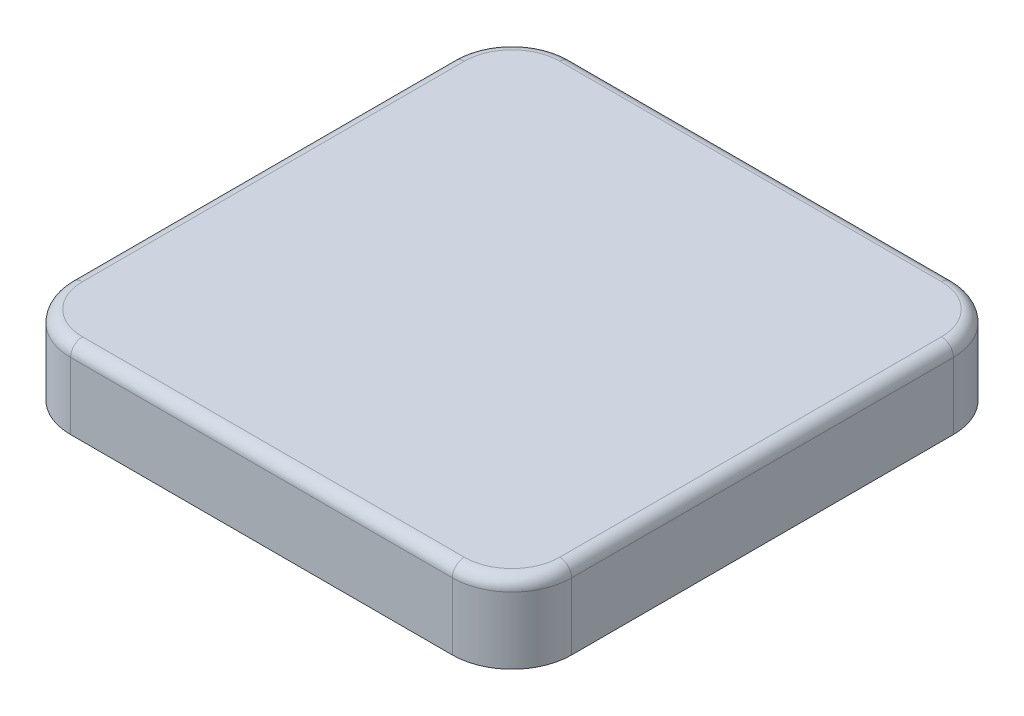
ISO-10303-21;
HEADER;
FILE_DESCRIPTION(('STEP AP214'),'2;1');
FILE_NAME('part.step','',(''),(''),'','','');
FILE_SCHEMA(('AUTOMOTIVE_DESIGN { 1 0 10303 214 1 1 1 1 }'));
ENDSEC;
DATA;
#1=APPLICATION_CONTEXT('core data for automotive mechanical design processes');
#2=APPLICATION_PROTOCOL_DEFINITION('international standard','automotive_design',2000,#1);
#3=PRODUCT_CONTEXT('',#1,'mechanical');
#4=PRODUCT('Part','Part','',(#3));
#5=PRODUCT_RELATED_PRODUCT_CATEGORY('part','',(#4));
#6=PRODUCT_DEFINITION_FORMATION('','',#4);
#7=PRODUCT_DEFINITION_CONTEXT('part definition',#1,'design');
#8=PRODUCT_DEFINITION('design','',#6,#7);
#9=PRODUCT_DEFINITION_SHAPE('','',#8);
#10=(LENGTH_UNIT() NAMED_UNIT(*) SI_UNIT(.MILLI.,.METRE.));
#11=(NAMED_UNIT(*) PLANE_ANGLE_UNIT() SI_UNIT($,.RADIAN.));
#12=(NAMED_UNIT(*) SI_UNIT($,.STERADIAN.) SOLID_ANGLE_UNIT());
#13=UNCERTAINTY_MEASURE_WITH_UNIT(LENGTH_MEASURE(1.E-05),#10,'distance_accuracy_value','');
#14=(GEOMETRIC_REPRESENTATION_CONTEXT(3) GLOBAL_UNCERTAINTY_ASSIGNED_CONTEXT((#13)) GLOBAL_UNIT_ASSIGNED_CONTEXT((#10,
#11,#12)) REPRESENTATION_CONTEXT('',''));
#15=CARTESIAN_POINT('',(0.,0.,0.));
#16=DIRECTION('',(0.,0.,1.));
#17=DIRECTION('',(1.,0.,0.));
#18=AXIS2_PLACEMENT_3D('',#15,#16,#17);
#19=CARTESIAN_POINT('',(0.,1.65,0.));
#20=DIRECTION('',(0.,1.,0.));
#21=DIRECTION('',(0.,0.,1.));
#22=AXIS2_PLACEMENT_3D('',#19,#20,#21);
#23=PLANE('',#22);
#24=DIRECTION('',(1.,0.,0.));
#25=VECTOR('',#24,1.);
#26=CARTESIAN_POINT('',(-4.02297299285185,1.65,5.));
#27=LINE('',#26,#25);
#28=CARTESIAN_POINT('',(3.99999999997342,1.65,5.));
#29=VERTEX_POINT('',#28);
#30=CARTESIAN_POINT('',(-3.99999999996086,1.65,5.));
#31=VERTEX_POINT('',#30);
#32=EDGE_CURVE('E262',#29,#31,#27,.F.);
#33=ORIENTED_EDGE('',*,*,#32,.F.);
#34=CARTESIAN_POINT('',(4.,1.65,4.));
#35=DIRECTION('',(0.,-1.,0.));
#36=DIRECTION('',(1.,0.,-1.56555324259955E-10));
#37=AXIS2_PLACEMENT_3D('',#34,#35,#36);
#38=CIRCLE('',#37,1.);
#39=CARTESIAN_POINT('',(5.,1.65,3.99999999996086));
#40=VERTEX_POINT('',#39);
#41=EDGE_CURVE('E258',#40,#29,#38,.T.);
#42=ORIENTED_EDGE('',*,*,#41,.F.);
#43=DIRECTION('',(0.,0.,-1.));
#44=VECTOR('',#43,1.);
#45=CARTESIAN_POINT('',(5.,1.65,4.02297299285186));
#46=LINE('',#45,#44);
#47=CARTESIAN_POINT('',(5.,1.65,-3.99999999997342));
#48=VERTEX_POINT('',#47);
#49=EDGE_CURVE('E247',#48,#40,#46,.F.);
#50=ORIENTED_EDGE('',*,*,#49,.F.);
#51=CARTESIAN_POINT('',(4.,1.65,-4.));
#52=DIRECTION('',(0.,-1.,0.));
#53=DIRECTION('',(-1.56555324259955E-10,0.,-1.));
#54=AXIS2_PLACEMENT_3D('',#51,#52,#53);
#55=CIRCLE('',#54,1.);
#56=CARTESIAN_POINT('',(3.99999999996086,1.65,-5.));
#57=VERTEX_POINT('',#56);
#58=EDGE_CURVE('E222',#57,#48,#55,.T.);
#59=ORIENTED_EDGE('',*,*,#58,.F.);
#60=DIRECTION('',(-1.,0.,0.));
#61=VECTOR('',#60,1.);
#62=CARTESIAN_POINT('',(4.02297299285185,1.65,-5.));
#63=LINE('',#62,#61);
#64=CARTESIAN_POINT('',(-3.99999999994684,1.65,-5.));
#65=VERTEX_POINT('',#64);
#66=EDGE_CURVE('E117',#65,#57,#63,.F.);
#67=ORIENTED_EDGE('',*,*,#66,.F.);
#68=CARTESIAN_POINT('',(-4.,1.65,-4.));
#69=DIRECTION('',(0.,-1.,0.));
#70=DIRECTION('',(-1.,0.,1.56555324259955E-10));
#71=AXIS2_PLACEMENT_3D('',#68,#69,#70);
#72=CIRCLE('',#71,1.);
#73=CARTESIAN_POINT('',(-5.,1.65,-3.99999999996086));
#74=VERTEX_POINT('',#73);
#75=EDGE_CURVE('E109',#74,#65,#72,.T.);
#76=ORIENTED_EDGE('',*,*,#75,.F.);
#77=DIRECTION('',(0.,0.,1.));
#78=VECTOR('',#77,1.);
#79=CARTESIAN_POINT('',(-5.,1.65,-4.02297299285186));
#80=LINE('',#79,#78);
#81=CARTESIAN_POINT('',(-5.,1.65,3.99999999997342));
#82=VERTEX_POINT('',#81);
#83=EDGE_CURVE('E113',#82,#74,#80,.F.);
#84=ORIENTED_EDGE('',*,*,#83,.F.);
#85=CARTESIAN_POINT('',(-4.,1.65,4.));
#86=DIRECTION('',(0.,-1.,0.));
#87=DIRECTION('',(1.56556191621693E-10,0.,1.));
#88=AXIS2_PLACEMENT_3D('',#85,#86,#87);
#89=CIRCLE('',#88,0.999999999999997);
#90=EDGE_CURVE('E288',#31,#82,#89,.T.);
#91=ORIENTED_EDGE('',*,*,#90,.F.);
#92=EDGE_LOOP('',(#33,#42,#50,#59,#67,#76,#84,#91));
#93=FACE_BOUND('',#92,.T.);
#94=ADVANCED_FACE('F16',(#93),#23,.T.);
#95=CARTESIAN_POINT('',(-4.,1.4,-4.));
#96=DIRECTION('',(0.,1.,0.));
#97=DIRECTION('',(0.0183773597014127,0.,-0.999831122065324));
#98=AXIS2_PLACEMENT_3D('',#95,#96,#97);
#99=TOROIDAL_SURFACE('',#98,1.,0.25);
#100=CARTESIAN_POINT('',(-5.,1.4,-4.));
#101=DIRECTION('',(0.,0.,1.));
#102=DIRECTION('',(1.,0.,0.));
#103=AXIS2_PLACEMENT_3D('',#100,#101,#102);
#104=CIRCLE('',#103,0.25);
#105=CARTESIAN_POINT('',(-5.25,1.4,-4.));
#106=VERTEX_POINT('',#105);
#107=EDGE_CURVE('E123',#74,#106,#104,.T.);
#108=ORIENTED_EDGE('',*,*,#107,.F.);
#109=ORIENTED_EDGE('',*,*,#75,.T.);
#110=CARTESIAN_POINT('',(-3.99999999989369,1.4,-5.));
#111=DIRECTION('',(-1.,0.,0.));
#112=DIRECTION('',(0.,0.,1.));
#113=AXIS2_PLACEMENT_3D('',#110,#111,#112);
#114=CIRCLE('',#113,0.25);
#115=CARTESIAN_POINT('',(-3.99999999997342,1.4,-5.25));
#116=VERTEX_POINT('',#115);
#117=EDGE_CURVE('E213',#116,#65,#114,.F.);
#118=ORIENTED_EDGE('',*,*,#117,.F.);
#119=CARTESIAN_POINT('',(-4.,1.4,-4.));
#120=DIRECTION('',(0.,1.,0.));
#121=DIRECTION('',(0.,0.,1.));
#122=AXIS2_PLACEMENT_3D('',#119,#120,#121);
#123=CIRCLE('',#122,1.25);
#124=EDGE_CURVE('E135',#106,#116,#123,.F.);
#125=ORIENTED_EDGE('',*,*,#124,.F.);
#126=EDGE_LOOP('',(#108,#109,#118,#125));
#127=FACE_BOUND('',#126,.T.);
#128=ADVANCED_FACE('F133',(#127),#99,.T.);
#129=CARTESIAN_POINT('',(-5.,1.4,-4.02297299285186));
#130=DIRECTION('',(0.,0.,1.));
#131=DIRECTION('',(1.,0.,0.));
#132=AXIS2_PLACEMENT_3D('',#129,#130,#131);
#133=CYLINDRICAL_SURFACE('',#132,0.25);
#134=CARTESIAN_POINT('',(-5.,1.4,4.));
#135=DIRECTION('',(0.,0.,1.));
#136=DIRECTION('',(-1.,0.,0.));
#137=AXIS2_PLACEMENT_3D('',#134,#135,#136);
#138=CIRCLE('',#137,0.25);
#139=CARTESIAN_POINT('',(-5.25,1.4,4.));
#140=VERTEX_POINT('',#139);
#141=EDGE_CURVE('E131',#82,#140,#138,.T.);
#142=ORIENTED_EDGE('',*,*,#141,.F.);
#143=ORIENTED_EDGE('',*,*,#83,.T.);
#144=ORIENTED_EDGE('',*,*,#107,.T.);
#145=DIRECTION('',(0.,0.,1.));
#146=VECTOR('',#145,1.);
#147=CARTESIAN_POINT('',(-5.25,1.4,-4.));
#148=LINE('',#147,#146);
#149=EDGE_CURVE('E203',#140,#106,#148,.F.);
#150=ORIENTED_EDGE('',*,*,#149,.F.);
#151=EDGE_LOOP('',(#142,#143,#144,#150));
#152=FACE_BOUND('',#151,.T.);
#153=ADVANCED_FACE('F128',(#152),#133,.T.);
#154=CARTESIAN_POINT('',(-4.,1.4,4.));
#155=DIRECTION('',(0.,1.,0.));
#156=DIRECTION('',(-0.999831122065324,0.,-0.0183773597014127));
#157=AXIS2_PLACEMENT_3D('',#154,#155,#156);
#158=TOROIDAL_SURFACE('',#157,1.,0.25);
#159=CARTESIAN_POINT('',(-4.,1.4,5.));
#160=DIRECTION('',(1.,0.,0.));
#161=DIRECTION('',(0.,0.,-1.));
#162=AXIS2_PLACEMENT_3D('',#159,#160,#161);
#163=CIRCLE('',#162,0.25);
#164=CARTESIAN_POINT('',(-4.,1.4,5.25));
#165=VERTEX_POINT('',#164);
#166=EDGE_CURVE('E85',#31,#165,#163,.T.);
#167=ORIENTED_EDGE('',*,*,#166,.F.);
#168=ORIENTED_EDGE('',*,*,#90,.T.);
#169=ORIENTED_EDGE('',*,*,#141,.T.);
#170=CARTESIAN_POINT('',(-4.,1.4,4.));
#171=DIRECTION('',(0.,1.,0.));
#172=DIRECTION('',(0.,0.,1.));
#173=AXIS2_PLACEMENT_3D('',#170,#171,#172);
#174=CIRCLE('',#173,1.25);
#175=EDGE_CURVE('E198',#165,#140,#174,.F.);
#176=ORIENTED_EDGE('',*,*,#175,.F.);
#177=EDGE_LOOP('',(#167,#168,#169,#176));
#178=FACE_BOUND('',#177,.T.);
#179=ADVANCED_FACE('F298',(#178),#158,.T.);
#180=CARTESIAN_POINT('',(-4.02297299285185,1.4,5.));
#181=DIRECTION('',(1.,0.,0.));
#182=DIRECTION('',(0.,0.,-1.));
#183=AXIS2_PLACEMENT_3D('',#180,#181,#182);
#184=CYLINDRICAL_SURFACE('',#183,0.25);
#185=CARTESIAN_POINT('',(4.,1.4,5.));
#186=DIRECTION('',(1.,0.,0.));
#187=DIRECTION('',(0.,0.,1.));
#188=AXIS2_PLACEMENT_3D('',#185,#186,#187);
#189=CIRCLE('',#188,0.25);
#190=CARTESIAN_POINT('',(4.,1.4,5.25));
#191=VERTEX_POINT('',#190);
#192=EDGE_CURVE('E77',#29,#191,#189,.T.);
#193=ORIENTED_EDGE('',*,*,#192,.F.);
#194=ORIENTED_EDGE('',*,*,#32,.T.);
#195=ORIENTED_EDGE('',*,*,#166,.T.);
#196=DIRECTION('',(1.,0.,0.));
#197=VECTOR('',#196,1.);
#198=CARTESIAN_POINT('',(-4.,1.4,5.25));
#199=LINE('',#198,#197);
#200=EDGE_CURVE('E195',#191,#165,#199,.F.);
#201=ORIENTED_EDGE('',*,*,#200,.F.);
#202=EDGE_LOOP('',(#193,#194,#195,#201));
#203=FACE_BOUND('',#202,.T.);
#204=ADVANCED_FACE('F274',(#203),#184,.T.);
#205=CARTESIAN_POINT('',(4.,1.4,4.));
#206=DIRECTION('',(0.,1.,0.));
#207=DIRECTION('',(-0.0183773597014136,0.,0.999831122065324));
#208=AXIS2_PLACEMENT_3D('',#205,#206,#207);
#209=TOROIDAL_SURFACE('',#208,1.,0.25);
#210=CARTESIAN_POINT('',(5.,1.4,4.));
#211=DIRECTION('',(0.,0.,-1.));
#212=DIRECTION('',(-1.,0.,0.));
#213=AXIS2_PLACEMENT_3D('',#210,#211,#212);
#214=CIRCLE('',#213,0.25);
#215=CARTESIAN_POINT('',(5.25,1.4,4.));
#216=VERTEX_POINT('',#215);
#217=EDGE_CURVE('E70',#40,#216,#214,.T.);
#218=ORIENTED_EDGE('',*,*,#217,.F.);
#219=ORIENTED_EDGE('',*,*,#41,.T.);
#220=ORIENTED_EDGE('',*,*,#192,.T.);
#221=CARTESIAN_POINT('',(4.,1.4,4.));
#222=DIRECTION('',(0.,1.,0.));
#223=DIRECTION('',(0.,0.,1.));
#224=AXIS2_PLACEMENT_3D('',#221,#222,#223);
#225=CIRCLE('',#224,1.25);
#226=EDGE_CURVE('E20',#216,#191,#225,.F.);
#227=ORIENTED_EDGE('',*,*,#226,.F.);
#228=EDGE_LOOP('',(#218,#219,#220,#227));
#229=FACE_BOUND('',#228,.T.);
#230=ADVANCED_FACE('F264',(#229),#209,.T.);
#231=CARTESIAN_POINT('',(5.,1.4,4.02297299285186));
#232=DIRECTION('',(0.,0.,-1.));
#233=DIRECTION('',(-1.,0.,0.));
#234=AXIS2_PLACEMENT_3D('',#231,#232,#233);
#235=CYLINDRICAL_SURFACE('',#234,0.25);
#236=CARTESIAN_POINT('',(5.,1.4,-4.));
#237=DIRECTION('',(0.,0.,-1.));
#238=DIRECTION('',(1.,0.,0.));
#239=AXIS2_PLACEMENT_3D('',#236,#237,#238);
#240=CIRCLE('',#239,0.25);
#241=CARTESIAN_POINT('',(5.25,1.4,-4.));
#242=VERTEX_POINT('',#241);
#243=EDGE_CURVE('E227',#48,#242,#240,.T.);
#244=ORIENTED_EDGE('',*,*,#243,.F.);
#245=ORIENTED_EDGE('',*,*,#49,.T.);
#246=ORIENTED_EDGE('',*,*,#217,.T.);
#247=DIRECTION('',(0.,0.,-1.));
#248=VECTOR('',#247,1.);
#249=CARTESIAN_POINT('',(5.25,1.4,4.));
#250=LINE('',#249,#248);
#251=EDGE_CURVE('E182',#242,#216,#250,.F.);
#252=ORIENTED_EDGE('',*,*,#251,.F.);
#253=EDGE_LOOP('',(#244,#245,#246,#252));
#254=FACE_BOUND('',#253,.T.);
#255=ADVANCED_FACE('F236',(#254),#235,.T.);
#256=CARTESIAN_POINT('',(4.,1.4,-4.));
#257=DIRECTION('',(0.,1.,0.));
#258=DIRECTION('',(0.999831122065324,0.,0.0183773597014127));
#259=AXIS2_PLACEMENT_3D('',#256,#257,#258);
#260=TOROIDAL_SURFACE('',#259,1.,0.25);
#261=CARTESIAN_POINT('',(4.,1.4,-5.));
#262=DIRECTION('',(-1.,0.,0.));
#263=DIRECTION('',(0.,0.,1.));
#264=AXIS2_PLACEMENT_3D('',#261,#262,#263);
#265=CIRCLE('',#264,0.25);
#266=CARTESIAN_POINT('',(4.,1.4,-5.25));
#267=VERTEX_POINT('',#266);
#268=EDGE_CURVE('E215',#57,#267,#265,.T.);
#269=ORIENTED_EDGE('',*,*,#268,.F.);
#270=ORIENTED_EDGE('',*,*,#58,.T.);
#271=ORIENTED_EDGE('',*,*,#243,.T.);
#272=CARTESIAN_POINT('',(4.,1.4,-4.));
#273=DIRECTION('',(0.,1.,0.));
#274=DIRECTION('',(0.,0.,1.));
#275=AXIS2_PLACEMENT_3D('',#272,#273,#274);
#276=CIRCLE('',#275,1.25);
#277=EDGE_CURVE('E174',#267,#242,#276,.F.);
#278=ORIENTED_EDGE('',*,*,#277,.F.);
#279=EDGE_LOOP('',(#269,#270,#271,#278));
#280=FACE_BOUND('',#279,.T.);
#281=ADVANCED_FACE('F230',(#280),#260,.T.);
#282=CARTESIAN_POINT('',(4.02297299285185,1.4,-5.));
#283=DIRECTION('',(-1.,0.,0.));
#284=DIRECTION('',(0.,0.,1.));
#285=AXIS2_PLACEMENT_3D('',#282,#283,#284);
#286=CYLINDRICAL_SURFACE('',#285,0.25);
#287=ORIENTED_EDGE('',*,*,#117,.T.);
#288=ORIENTED_EDGE('',*,*,#66,.T.);
#289=ORIENTED_EDGE('',*,*,#268,.T.);
#290=DIRECTION('',(-1.,0.,0.));
#291=VECTOR('',#290,1.);
#292=CARTESIAN_POINT('',(4.,1.4,-5.25));
#293=LINE('',#292,#291);
#294=EDGE_CURVE('E173',#116,#267,#293,.F.);
#295=ORIENTED_EDGE('',*,*,#294,.F.);
#296=EDGE_LOOP('',(#287,#288,#289,#295));
#297=FACE_BOUND('',#296,.T.);
#298=ADVANCED_FACE('F235',(#297),#286,.T.);
#299=CARTESIAN_POINT('',(-4.,0.,-4.));
#300=DIRECTION('',(0.,1.,0.));
#301=DIRECTION('',(0.,0.,1.));
#302=AXIS2_PLACEMENT_3D('',#299,#300,#301);
#303=CYLINDRICAL_SURFACE('',#302,1.25);
#304=DIRECTION('',(0.,1.,0.));
#305=VECTOR('',#304,1.);
#306=CARTESIAN_POINT('',(-5.25,0.,-4.));
#307=LINE('',#306,#305);
#308=CARTESIAN_POINT('',(-5.25,0.,-4.));
#309=VERTEX_POINT('',#308);
#310=EDGE_CURVE('E206',#106,#309,#307,.F.);
#311=ORIENTED_EDGE('',*,*,#310,.F.);
#312=ORIENTED_EDGE('',*,*,#124,.T.);
#313=DIRECTION('',(0.,1.,0.));
#314=VECTOR('',#313,1.);
#315=CARTESIAN_POINT('',(-4.,0.,-5.25));
#316=LINE('',#315,#314);
#317=CARTESIAN_POINT('',(-4.,0.,-5.25));
#318=VERTEX_POINT('',#317);
#319=EDGE_CURVE('E180',#318,#116,#316,.T.);
#320=ORIENTED_EDGE('',*,*,#319,.F.);
#321=CARTESIAN_POINT('',(-4.,0.,-4.));
#322=DIRECTION('',(0.,1.,0.));
#323=DIRECTION('',(0.,0.,1.));
#324=AXIS2_PLACEMENT_3D('',#321,#322,#323);
#325=CIRCLE('',#324,1.25);
#326=EDGE_CURVE('E171',#318,#309,#325,.T.);
#327=ORIENTED_EDGE('',*,*,#326,.T.);
#328=EDGE_LOOP('',(#311,#312,#320,#327));
#329=FACE_BOUND('',#328,.T.);
#330=ADVANCED_FACE('F327',(#329),#303,.T.);
#331=CARTESIAN_POINT('',(-5.25,0.,-4.));
#332=DIRECTION('',(-1.,0.,0.));
#333=DIRECTION('',(0.,0.,1.));
#334=AXIS2_PLACEMENT_3D('',#331,#332,#333);
#335=PLANE('',#334);
#336=DIRECTION('',(0.,1.,0.));
#337=VECTOR('',#336,1.);
#338=CARTESIAN_POINT('',(-5.25,0.,4.));
#339=LINE('',#338,#337);
#340=CARTESIAN_POINT('',(-5.25,0.,4.));
#341=VERTEX_POINT('',#340);
#342=EDGE_CURVE('E201',#140,#341,#339,.F.);
#343=ORIENTED_EDGE('',*,*,#342,.F.);
#344=ORIENTED_EDGE('',*,*,#149,.T.);
#345=ORIENTED_EDGE('',*,*,#310,.T.);
#346=DIRECTION('',(0.,0.,1.));
#347=VECTOR('',#346,1.);
#348=CARTESIAN_POINT('',(-5.25,0.,0.));
#349=LINE('',#348,#347);
#350=EDGE_CURVE('E170',#309,#341,#349,.T.);
#351=ORIENTED_EDGE('',*,*,#350,.T.);
#352=EDGE_LOOP('',(#343,#344,#345,#351));
#353=FACE_BOUND('',#352,.T.);
#354=ADVANCED_FACE('F357',(#353),#335,.T.);
#355=CARTESIAN_POINT('',(-4.,0.,4.));
#356=DIRECTION('',(0.,1.,0.));
#357=DIRECTION('',(0.,0.,1.));
#358=AXIS2_PLACEMENT_3D('',#355,#356,#357);
#359=CYLINDRICAL_SURFACE('',#358,1.25);
#360=DIRECTION('',(0.,1.,0.));
#361=VECTOR('',#360,1.);
#362=CARTESIAN_POINT('',(-4.,0.,5.25));
#363=LINE('',#362,#361);
#364=CARTESIAN_POINT('',(-4.,0.,5.25));
#365=VERTEX_POINT('',#364);
#366=EDGE_CURVE('E196',#165,#365,#363,.F.);
#367=ORIENTED_EDGE('',*,*,#366,.F.);
#368=ORIENTED_EDGE('',*,*,#175,.T.);
#369=ORIENTED_EDGE('',*,*,#342,.T.);
#370=CARTESIAN_POINT('',(-4.,0.,4.));
#371=DIRECTION('',(0.,1.,0.));
#372=DIRECTION('',(0.,0.,1.));
#373=AXIS2_PLACEMENT_3D('',#370,#371,#372);
#374=CIRCLE('',#373,1.25);
#375=EDGE_CURVE('E167',#341,#365,#374,.T.);
#376=ORIENTED_EDGE('',*,*,#375,.T.);
#377=EDGE_LOOP('',(#367,#368,#369,#376));
#378=FACE_BOUND('',#377,.T.);
#379=ADVANCED_FACE('F359',(#378),#359,.T.);
#380=CARTESIAN_POINT('',(-4.,0.,5.25));
#381=DIRECTION('',(0.,0.,1.));
#382=DIRECTION('',(1.,0.,0.));
#383=AXIS2_PLACEMENT_3D('',#380,#381,#382);
#384=PLANE('',#383);
#385=DIRECTION('',(0.,1.,0.));
#386=VECTOR('',#385,1.);
#387=CARTESIAN_POINT('',(4.,0.,5.25));
#388=LINE('',#387,#386);
#389=CARTESIAN_POINT('',(4.,0.,5.25));
#390=VERTEX_POINT('',#389);
#391=EDGE_CURVE('E193',#191,#390,#388,.F.);
#392=ORIENTED_EDGE('',*,*,#391,.F.);
#393=ORIENTED_EDGE('',*,*,#200,.T.);
#394=ORIENTED_EDGE('',*,*,#366,.T.);
#395=DIRECTION('',(1.,0.,0.));
#396=VECTOR('',#395,1.);
#397=CARTESIAN_POINT('',(0.,0.,5.25));
#398=LINE('',#397,#396);
#399=EDGE_CURVE('E166',#365,#390,#398,.T.);
#400=ORIENTED_EDGE('',*,*,#399,.T.);
#401=EDGE_LOOP('',(#392,#393,#394,#400));
#402=FACE_BOUND('',#401,.T.);
#403=ADVANCED_FACE('F348',(#402),#384,.T.);
#404=CARTESIAN_POINT('',(4.,0.,4.));
#405=DIRECTION('',(0.,1.,0.));
#406=DIRECTION('',(0.,0.,1.));
#407=AXIS2_PLACEMENT_3D('',#404,#405,#406);
#408=CYLINDRICAL_SURFACE('',#407,1.25);
#409=DIRECTION('',(0.,1.,0.));
#410=VECTOR('',#409,1.);
#411=CARTESIAN_POINT('',(5.25,0.,4.));
#412=LINE('',#411,#410);
#413=CARTESIAN_POINT('',(5.25,0.,4.));
#414=VERTEX_POINT('',#413);
#415=EDGE_CURVE('E186',#216,#414,#412,.F.);
#416=ORIENTED_EDGE('',*,*,#415,.F.);
#417=ORIENTED_EDGE('',*,*,#226,.T.);
#418=ORIENTED_EDGE('',*,*,#391,.T.);
#419=CARTESIAN_POINT('',(4.,0.,4.));
#420=DIRECTION('',(0.,1.,0.));
#421=DIRECTION('',(0.,0.,1.));
#422=AXIS2_PLACEMENT_3D('',#419,#420,#421);
#423=CIRCLE('',#422,1.25);
#424=EDGE_CURVE('E163',#390,#414,#423,.T.);
#425=ORIENTED_EDGE('',*,*,#424,.T.);
#426=EDGE_LOOP('',(#416,#417,#418,#425));
#427=FACE_BOUND('',#426,.T.);
#428=ADVANCED_FACE('F339',(#427),#408,.T.);
#429=CARTESIAN_POINT('',(5.25,0.,4.));
#430=DIRECTION('',(1.,0.,0.));
#431=DIRECTION('',(0.,0.,-1.));
#432=AXIS2_PLACEMENT_3D('',#429,#430,#431);
#433=PLANE('',#432);
#434=DIRECTION('',(0.,1.,0.));
#435=VECTOR('',#434,1.);
#436=CARTESIAN_POINT('',(5.25,0.,-4.));
#437=LINE('',#436,#435);
#438=CARTESIAN_POINT('',(5.25,0.,-4.));
#439=VERTEX_POINT('',#438);
#440=EDGE_CURVE('E176',#242,#439,#437,.F.);
#441=ORIENTED_EDGE('',*,*,#440,.F.);
#442=ORIENTED_EDGE('',*,*,#251,.T.);
#443=ORIENTED_EDGE('',*,*,#415,.T.);
#444=DIRECTION('',(0.,0.,1.));
#445=VECTOR('',#444,1.);
#446=CARTESIAN_POINT('',(5.25,0.,0.));
#447=LINE('',#446,#445);
#448=EDGE_CURVE('E162',#414,#439,#447,.F.);
#449=ORIENTED_EDGE('',*,*,#448,.T.);
#450=EDGE_LOOP('',(#441,#442,#443,#449));
#451=FACE_BOUND('',#450,.T.);
#452=ADVANCED_FACE('F335',(#451),#433,.T.);
#453=CARTESIAN_POINT('',(4.,0.,-4.));
#454=DIRECTION('',(0.,1.,0.));
#455=DIRECTION('',(0.,0.,1.));
#456=AXIS2_PLACEMENT_3D('',#453,#454,#455);
#457=CYLINDRICAL_SURFACE('',#456,1.25);
#458=DIRECTION('',(0.,1.,0.));
#459=VECTOR('',#458,1.);
#460=CARTESIAN_POINT('',(4.,0.,-5.25));
#461=LINE('',#460,#459);
#462=CARTESIAN_POINT('',(4.,0.,-5.25));
#463=VERTEX_POINT('',#462);
#464=EDGE_CURVE('E34',#267,#463,#461,.F.);
#465=ORIENTED_EDGE('',*,*,#464,.F.);
#466=ORIENTED_EDGE('',*,*,#277,.T.);
#467=ORIENTED_EDGE('',*,*,#440,.T.);
#468=CARTESIAN_POINT('',(4.,0.,-4.));
#469=DIRECTION('',(0.,1.,0.));
#470=DIRECTION('',(0.,0.,1.));
#471=AXIS2_PLACEMENT_3D('',#468,#469,#470);
#472=CIRCLE('',#471,1.25);
#473=EDGE_CURVE('E26',#439,#463,#472,.T.);
#474=ORIENTED_EDGE('',*,*,#473,.T.);
#475=EDGE_LOOP('',(#465,#466,#467,#474));
#476=FACE_BOUND('',#475,.T.);
#477=ADVANCED_FACE('F374',(#476),#457,.T.);
#478=CARTESIAN_POINT('',(4.,0.,-5.25));
#479=DIRECTION('',(0.,0.,-1.));
#480=DIRECTION('',(-1.,0.,0.));
#481=AXIS2_PLACEMENT_3D('',#478,#479,#480);
#482=PLANE('',#481);
#483=ORIENTED_EDGE('',*,*,#319,.T.);
#484=ORIENTED_EDGE('',*,*,#294,.T.);
#485=ORIENTED_EDGE('',*,*,#464,.T.);
#486=DIRECTION('',(1.,0.,0.));
#487=VECTOR('',#486,1.);
#488=CARTESIAN_POINT('',(0.,0.,-5.25));
#489=LINE('',#488,#487);
#490=EDGE_CURVE('E11',#463,#318,#489,.F.);
#491=ORIENTED_EDGE('',*,*,#490,.T.);
#492=EDGE_LOOP('',(#483,#484,#485,#491));
#493=FACE_BOUND('',#492,.T.);
#494=ADVANCED_FACE('F328',(#493),#482,.T.);
#495=CARTESIAN_POINT('',(0.,0.,0.));
#496=DIRECTION('',(0.,1.,0.));
#497=DIRECTION('',(0.,0.,1.));
#498=AXIS2_PLACEMENT_3D('',#495,#496,#497);
#499=PLANE('',#498);
#500=ORIENTED_EDGE('',*,*,#473,.F.);
#501=ORIENTED_EDGE('',*,*,#448,.F.);
#502=ORIENTED_EDGE('',*,*,#424,.F.);
#503=ORIENTED_EDGE('',*,*,#399,.F.);
#504=ORIENTED_EDGE('',*,*,#375,.F.);
#505=ORIENTED_EDGE('',*,*,#350,.F.);
#506=ORIENTED_EDGE('',*,*,#326,.F.);
#507=ORIENTED_EDGE('',*,*,#490,.F.);
#508=EDGE_LOOP('',(#500,#501,#502,#503,#504,#505,#506,#507));
#509=FACE_BOUND('',#508,.T.);
#510=ADVANCED_FACE('F345',(#509),#499,.F.);
#511=CLOSED_SHELL('',(#94,#128,#153,#179,#204,#230,#255,#281,#298,#330,#354,#379,#403,#428,#452,
#477,#494,#510));
#512=MANIFOLD_SOLID_BREP('B1',#511);
#513=ADVANCED_BREP_SHAPE_REPRESENTATION('',(#18,#512),#14);
#514=SHAPE_DEFINITION_REPRESENTATION(#9,#513);
ENDSEC;
END-ISO-10303-21;
